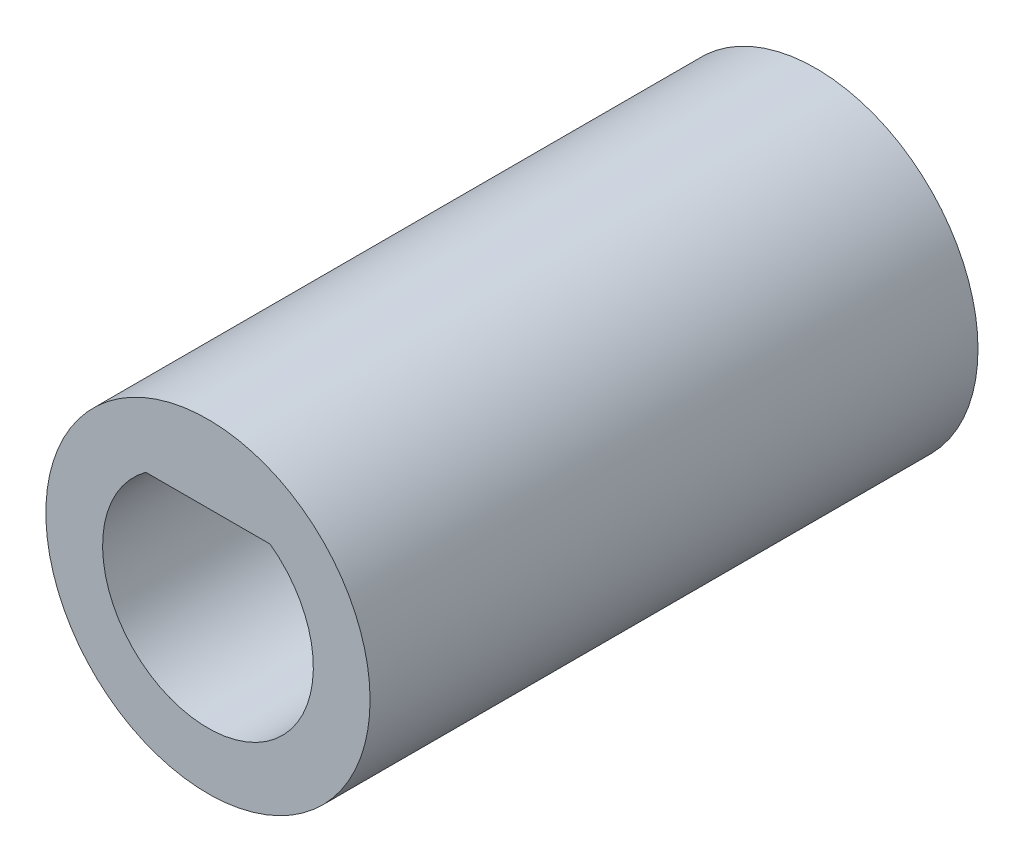
ISO-10303-21;
HEADER;
FILE_DESCRIPTION(('STEP AP214'),'2;1');
FILE_NAME('part.step','',(''),(''),'','','');
FILE_SCHEMA(('AUTOMOTIVE_DESIGN { 1 0 10303 214 1 1 1 1 }'));
ENDSEC;
DATA;
#1=APPLICATION_CONTEXT('core data for automotive mechanical design processes');
#2=APPLICATION_PROTOCOL_DEFINITION('international standard','automotive_design',2000,#1);
#3=PRODUCT_CONTEXT('',#1,'mechanical');
#4=PRODUCT('Part','Part','',(#3));
#5=PRODUCT_RELATED_PRODUCT_CATEGORY('part','',(#4));
#6=PRODUCT_DEFINITION_FORMATION('','',#4);
#7=PRODUCT_DEFINITION_CONTEXT('part definition',#1,'design');
#8=PRODUCT_DEFINITION('design','',#6,#7);
#9=PRODUCT_DEFINITION_SHAPE('','',#8);
#10=(LENGTH_UNIT() NAMED_UNIT(*) SI_UNIT(.MILLI.,.METRE.));
#11=(NAMED_UNIT(*) PLANE_ANGLE_UNIT() SI_UNIT($,.RADIAN.));
#12=(NAMED_UNIT(*) SI_UNIT($,.STERADIAN.) SOLID_ANGLE_UNIT());
#13=UNCERTAINTY_MEASURE_WITH_UNIT(LENGTH_MEASURE(1.E-05),#10,'distance_accuracy_value','');
#14=(GEOMETRIC_REPRESENTATION_CONTEXT(3) GLOBAL_UNCERTAINTY_ASSIGNED_CONTEXT((#13)) GLOBAL_UNIT_ASSIGNED_CONTEXT((#10,
#11,#12)) REPRESENTATION_CONTEXT('',''));
#15=CARTESIAN_POINT('',(0.,0.,0.));
#16=DIRECTION('',(0.,0.,1.));
#17=DIRECTION('',(1.,0.,0.));
#18=AXIS2_PLACEMENT_3D('',#15,#16,#17);
#19=CARTESIAN_POINT('',(0.,0.,0.));
#20=DIRECTION('',(0.,0.,1.));
#21=DIRECTION('',(1.,0.,0.));
#22=AXIS2_PLACEMENT_3D('',#19,#20,#21);
#23=PLANE('',#22);
#24=CARTESIAN_POINT('',(0.,0.,0.));
#25=DIRECTION('',(0.,0.,1.));
#26=DIRECTION('',(1.,0.,0.));
#27=AXIS2_PLACEMENT_3D('',#24,#25,#26);
#28=CIRCLE('',#27,2.6);
#29=CARTESIAN_POINT('',(2.51743917503482,-0.650000000000001,0.));
#30=VERTEX_POINT('',#29);
#31=CARTESIAN_POINT('',(2.51743917503482,0.65,0.));
#32=VERTEX_POINT('',#31);
#33=EDGE_CURVE('E179',#30,#32,#28,.T.);
#34=ORIENTED_EDGE('',*,*,#33,.T.);
#35=DIRECTION('',(-1.,0.,0.));
#36=VECTOR('',#35,1.);
#37=CARTESIAN_POINT('',(2.92873692912149,0.65,0.));
#38=LINE('',#37,#36);
#39=CARTESIAN_POINT('',(-2.51743917503482,0.650000000000002,0.));
#40=VERTEX_POINT('',#39);
#41=EDGE_CURVE('E121',#32,#40,#38,.T.);
#42=ORIENTED_EDGE('',*,*,#41,.T.);
#43=CARTESIAN_POINT('',(-2.51743917503482,-0.650000000000001,0.));
#44=VERTEX_POINT('',#43);
#45=EDGE_CURVE('E148',#40,#44,#28,.T.);
#46=ORIENTED_EDGE('',*,*,#45,.T.);
#47=DIRECTION('',(1.,0.,0.));
#48=VECTOR('',#47,1.);
#49=CARTESIAN_POINT('',(2.92873692912149,-0.650000000000001,0.));
#50=LINE('',#49,#48);
#51=EDGE_CURVE('E137',#44,#30,#50,.T.);
#52=ORIENTED_EDGE('',*,*,#51,.T.);
#53=EDGE_LOOP('',(#34,#42,#46,#52));
#54=FACE_BOUND('',#53,.T.);
#55=ADVANCED_FACE('F36',(#54),#23,.T.);
#56=CARTESIAN_POINT('',(0.,0.,7.5));
#57=DIRECTION('',(0.,0.,-1.));
#58=DIRECTION('',(-1.,0.,0.));
#59=AXIS2_PLACEMENT_3D('',#56,#57,#58);
#60=CYLINDRICAL_SURFACE('',#59,4.);
#61=CARTESIAN_POINT('',(0.,0.,7.5));
#62=DIRECTION('',(0.,0.,1.));
#63=DIRECTION('',(1.,0.,0.));
#64=AXIS2_PLACEMENT_3D('',#61,#62,#63);
#65=CIRCLE('',#64,4.);
#66=CARTESIAN_POINT('',(4.,0.,7.5));
#67=VERTEX_POINT('',#66);
#68=EDGE_CURVE('E11',#67,#67,#65,.T.);
#69=ORIENTED_EDGE('',*,*,#68,.F.);
#70=EDGE_LOOP('',(#69));
#71=FACE_BOUND('',#70,.T.);
#72=CARTESIAN_POINT('',(0.,0.,-7.5));
#73=DIRECTION('',(0.,0.,1.));
#74=DIRECTION('',(1.,0.,0.));
#75=AXIS2_PLACEMENT_3D('',#72,#73,#74);
#76=CIRCLE('',#75,4.);
#77=CARTESIAN_POINT('',(4.,0.,-7.5));
#78=VERTEX_POINT('',#77);
#79=EDGE_CURVE('E40',#78,#78,#76,.T.);
#80=ORIENTED_EDGE('',*,*,#79,.T.);
#81=EDGE_LOOP('',(#80));
#82=FACE_BOUND('',#81,.T.);
#83=ADVANCED_FACE('F38',(#71,#82),#60,.T.);
#84=CARTESIAN_POINT('',(0.,0.,7.5));
#85=DIRECTION('',(0.,0.,1.));
#86=DIRECTION('',(1.,0.,0.));
#87=AXIS2_PLACEMENT_3D('',#84,#85,#86);
#88=PLANE('',#87);
#89=CARTESIAN_POINT('',(0.,0.,7.5));
#90=DIRECTION('',(0.,0.,1.));
#91=DIRECTION('',(1.,0.,0.));
#92=AXIS2_PLACEMENT_3D('',#89,#90,#91);
#93=CIRCLE('',#92,2.6);
#94=CARTESIAN_POINT('',(-1.53297097167559,2.1,7.5));
#95=VERTEX_POINT('',#94);
#96=CARTESIAN_POINT('',(1.53297097167559,2.1,7.5));
#97=VERTEX_POINT('',#96);
#98=EDGE_CURVE('E127',#95,#97,#93,.T.);
#99=ORIENTED_EDGE('',*,*,#98,.F.);
#100=DIRECTION('',(-1.,0.,0.));
#101=VECTOR('',#100,1.);
#102=CARTESIAN_POINT('',(-1.53297097167559,2.1,7.5));
#103=LINE('',#102,#101);
#104=EDGE_CURVE('E153',#97,#95,#103,.T.);
#105=ORIENTED_EDGE('',*,*,#104,.F.);
#106=EDGE_LOOP('',(#99,#105));
#107=FACE_BOUND('',#106,.T.);
#108=ORIENTED_EDGE('',*,*,#68,.T.);
#109=EDGE_LOOP('',(#108));
#110=FACE_BOUND('',#109,.T.);
#111=ADVANCED_FACE('F168',(#107,#110),#88,.T.);
#112=CARTESIAN_POINT('',(0.,0.,-7.5));
#113=DIRECTION('',(0.,0.,1.));
#114=DIRECTION('',(1.,0.,0.));
#115=AXIS2_PLACEMENT_3D('',#112,#113,#114);
#116=PLANE('',#115);
#117=DIRECTION('',(-1.,0.,0.));
#118=VECTOR('',#117,1.);
#119=CARTESIAN_POINT('',(2.92873692912149,0.65,-7.5));
#120=LINE('',#119,#118);
#121=CARTESIAN_POINT('',(2.92873692912149,0.65,-7.5));
#122=VERTEX_POINT('',#121);
#123=CARTESIAN_POINT('',(-2.92873692912149,0.650000000000002,-7.5));
#124=VERTEX_POINT('',#123);
#125=EDGE_CURVE('E117',#122,#124,#120,.T.);
#126=ORIENTED_EDGE('',*,*,#125,.F.);
#127=CARTESIAN_POINT('',(0.,0.,-7.5));
#128=DIRECTION('',(0.,0.,-1.));
#129=DIRECTION('',(-1.,0.,0.));
#130=AXIS2_PLACEMENT_3D('',#127,#128,#129);
#131=CIRCLE('',#130,3.);
#132=EDGE_CURVE('E106',#124,#122,#131,.T.);
#133=ORIENTED_EDGE('',*,*,#132,.F.);
#134=EDGE_LOOP('',(#126,#133));
#135=FACE_BOUND('',#134,.T.);
#136=DIRECTION('',(1.,0.,0.));
#137=VECTOR('',#136,1.);
#138=CARTESIAN_POINT('',(2.92873692912149,-0.650000000000001,-7.5));
#139=LINE('',#138,#137);
#140=CARTESIAN_POINT('',(-2.92873692912149,-0.650000000000001,-7.5));
#141=VERTEX_POINT('',#140);
#142=CARTESIAN_POINT('',(2.92873692912149,-0.650000000000001,-7.5));
#143=VERTEX_POINT('',#142);
#144=EDGE_CURVE('E132',#141,#143,#139,.T.);
#145=ORIENTED_EDGE('',*,*,#144,.F.);
#146=CARTESIAN_POINT('',(0.,0.,-7.5));
#147=DIRECTION('',(0.,0.,-1.));
#148=DIRECTION('',(-1.,0.,0.));
#149=AXIS2_PLACEMENT_3D('',#146,#147,#148);
#150=CIRCLE('',#149,3.);
#151=EDGE_CURVE('E138',#143,#141,#150,.T.);
#152=ORIENTED_EDGE('',*,*,#151,.F.);
#153=EDGE_LOOP('',(#145,#152));
#154=FACE_BOUND('',#153,.T.);
#155=ORIENTED_EDGE('',*,*,#79,.F.);
#156=EDGE_LOOP('',(#155));
#157=FACE_BOUND('',#156,.T.);
#158=ADVANCED_FACE('F190',(#135,#154,#157),#116,.F.);
#159=CARTESIAN_POINT('',(0.,0.,0.));
#160=DIRECTION('',(0.,0.,1.));
#161=DIRECTION('',(1.,0.,0.));
#162=AXIS2_PLACEMENT_3D('',#159,#160,#161);
#163=CYLINDRICAL_SURFACE('',#162,2.6);
#164=ORIENTED_EDGE('',*,*,#98,.T.);
#165=DIRECTION('',(0.,0.,1.));
#166=VECTOR('',#165,1.);
#167=CARTESIAN_POINT('',(1.53297097167559,2.1,0.));
#168=LINE('',#167,#166);
#169=CARTESIAN_POINT('',(1.53297097167559,2.1,0.));
#170=VERTEX_POINT('',#169);
#171=EDGE_CURVE('E151',#170,#97,#168,.T.);
#172=ORIENTED_EDGE('',*,*,#171,.F.);
#173=EDGE_CURVE('E149',#32,#170,#28,.T.);
#174=ORIENTED_EDGE('',*,*,#173,.F.);
#175=ORIENTED_EDGE('',*,*,#33,.F.);
#176=EDGE_CURVE('E180',#44,#30,#28,.T.);
#177=ORIENTED_EDGE('',*,*,#176,.F.);
#178=ORIENTED_EDGE('',*,*,#45,.F.);
#179=CARTESIAN_POINT('',(-1.53297097167559,2.1,0.));
#180=VERTEX_POINT('',#179);
#181=EDGE_CURVE('E145',#180,#40,#28,.T.);
#182=ORIENTED_EDGE('',*,*,#181,.F.);
#183=DIRECTION('',(0.,0.,1.));
#184=VECTOR('',#183,1.);
#185=CARTESIAN_POINT('',(-1.53297097167559,2.1,0.));
#186=LINE('',#185,#184);
#187=EDGE_CURVE('E156',#180,#95,#186,.T.);
#188=ORIENTED_EDGE('',*,*,#187,.T.);
#189=EDGE_LOOP('',(#164,#172,#174,#175,#177,#178,#182,#188));
#190=FACE_BOUND('',#189,.T.);
#191=ADVANCED_FACE('F170',(#190),#163,.F.);
#192=CARTESIAN_POINT('',(-1.53297097167559,2.1,0.));
#193=DIRECTION('',(0.,1.,0.));
#194=DIRECTION('',(0.,0.,1.));
#195=AXIS2_PLACEMENT_3D('',#192,#193,#194);
#196=PLANE('',#195);
#197=ORIENTED_EDGE('',*,*,#104,.T.);
#198=ORIENTED_EDGE('',*,*,#187,.F.);
#199=DIRECTION('',(-1.,0.,0.));
#200=VECTOR('',#199,1.);
#201=CARTESIAN_POINT('',(-1.53297097167559,2.1,0.));
#202=LINE('',#201,#200);
#203=EDGE_CURVE('E147',#170,#180,#202,.T.);
#204=ORIENTED_EDGE('',*,*,#203,.F.);
#205=ORIENTED_EDGE('',*,*,#171,.T.);
#206=EDGE_LOOP('',(#197,#198,#204,#205));
#207=FACE_BOUND('',#206,.T.);
#208=ADVANCED_FACE('F163',(#207),#196,.F.);
#209=CARTESIAN_POINT('',(0.,0.,0.));
#210=DIRECTION('',(0.,0.,-1.));
#211=DIRECTION('',(-1.,0.,0.));
#212=AXIS2_PLACEMENT_3D('',#209,#210,#211);
#213=PLANE('',#212);
#214=ORIENTED_EDGE('',*,*,#176,.T.);
#215=CARTESIAN_POINT('',(2.92873692912149,-0.650000000000001,0.));
#216=VERTEX_POINT('',#215);
#217=EDGE_CURVE('E51',#30,#216,#50,.T.);
#218=ORIENTED_EDGE('',*,*,#217,.T.);
#219=CARTESIAN_POINT('',(0.,0.,0.));
#220=DIRECTION('',(0.,0.,-1.));
#221=DIRECTION('',(-1.,0.,0.));
#222=AXIS2_PLACEMENT_3D('',#219,#220,#221);
#223=CIRCLE('',#222,3.);
#224=CARTESIAN_POINT('',(-2.92873692912149,-0.650000000000001,0.));
#225=VERTEX_POINT('',#224);
#226=EDGE_CURVE('E129',#216,#225,#223,.T.);
#227=ORIENTED_EDGE('',*,*,#226,.T.);
#228=EDGE_CURVE('E133',#225,#44,#50,.T.);
#229=ORIENTED_EDGE('',*,*,#228,.T.);
#230=EDGE_LOOP('',(#214,#218,#227,#229));
#231=FACE_BOUND('',#230,.T.);
#232=ADVANCED_FACE('F182',(#231),#213,.T.);
#233=CARTESIAN_POINT('',(0.,0.,0.));
#234=DIRECTION('',(0.,0.,-1.));
#235=DIRECTION('',(-1.,0.,0.));
#236=AXIS2_PLACEMENT_3D('',#233,#234,#235);
#237=CYLINDRICAL_SURFACE('',#236,3.);
#238=ORIENTED_EDGE('',*,*,#151,.T.);
#239=DIRECTION('',(0.,0.,-1.));
#240=VECTOR('',#239,1.);
#241=CARTESIAN_POINT('',(-2.92873692912149,-0.650000000000001,0.));
#242=LINE('',#241,#240);
#243=EDGE_CURVE('E136',#225,#141,#242,.T.);
#244=ORIENTED_EDGE('',*,*,#243,.F.);
#245=ORIENTED_EDGE('',*,*,#226,.F.);
#246=DIRECTION('',(0.,0.,-1.));
#247=VECTOR('',#246,1.);
#248=CARTESIAN_POINT('',(2.92873692912149,-0.650000000000001,0.));
#249=LINE('',#248,#247);
#250=EDGE_CURVE('E125',#216,#143,#249,.T.);
#251=ORIENTED_EDGE('',*,*,#250,.T.);
#252=EDGE_LOOP('',(#238,#244,#245,#251));
#253=FACE_BOUND('',#252,.T.);
#254=ADVANCED_FACE('F192',(#253),#237,.F.);
#255=CARTESIAN_POINT('',(2.92873692912149,-0.650000000000001,0.));
#256=DIRECTION('',(0.,1.,0.));
#257=DIRECTION('',(0.,0.,1.));
#258=AXIS2_PLACEMENT_3D('',#255,#256,#257);
#259=PLANE('',#258);
#260=ORIENTED_EDGE('',*,*,#144,.T.);
#261=ORIENTED_EDGE('',*,*,#250,.F.);
#262=ORIENTED_EDGE('',*,*,#217,.F.);
#263=ORIENTED_EDGE('',*,*,#51,.F.);
#264=ORIENTED_EDGE('',*,*,#228,.F.);
#265=ORIENTED_EDGE('',*,*,#243,.T.);
#266=EDGE_LOOP('',(#260,#261,#262,#263,#264,#265));
#267=FACE_BOUND('',#266,.T.);
#268=ADVANCED_FACE('F185',(#267),#259,.F.);
#269=CARTESIAN_POINT('',(0.,0.,0.));
#270=DIRECTION('',(0.,0.,-1.));
#271=DIRECTION('',(-1.,0.,0.));
#272=AXIS2_PLACEMENT_3D('',#269,#270,#271);
#273=PLANE('',#272);
#274=ORIENTED_EDGE('',*,*,#181,.T.);
#275=CARTESIAN_POINT('',(-2.92873692912149,0.650000000000002,0.));
#276=VERTEX_POINT('',#275);
#277=EDGE_CURVE('E59',#40,#276,#38,.T.);
#278=ORIENTED_EDGE('',*,*,#277,.T.);
#279=CARTESIAN_POINT('',(0.,0.,0.));
#280=DIRECTION('',(0.,0.,-1.));
#281=DIRECTION('',(-1.,0.,0.));
#282=AXIS2_PLACEMENT_3D('',#279,#280,#281);
#283=CIRCLE('',#282,3.);
#284=CARTESIAN_POINT('',(2.92873692912149,0.65,0.));
#285=VERTEX_POINT('',#284);
#286=EDGE_CURVE('E104',#276,#285,#283,.T.);
#287=ORIENTED_EDGE('',*,*,#286,.T.);
#288=EDGE_CURVE('E111',#285,#32,#38,.T.);
#289=ORIENTED_EDGE('',*,*,#288,.T.);
#290=ORIENTED_EDGE('',*,*,#173,.T.);
#291=ORIENTED_EDGE('',*,*,#203,.T.);
#292=EDGE_LOOP('',(#274,#278,#287,#289,#290,#291));
#293=FACE_BOUND('',#292,.T.);
#294=ADVANCED_FACE('F115',(#293),#273,.T.);
#295=CARTESIAN_POINT('',(0.,0.,0.));
#296=DIRECTION('',(0.,0.,-1.));
#297=DIRECTION('',(-1.,0.,0.));
#298=AXIS2_PLACEMENT_3D('',#295,#296,#297);
#299=CYLINDRICAL_SURFACE('',#298,3.);
#300=ORIENTED_EDGE('',*,*,#132,.T.);
#301=DIRECTION('',(0.,0.,-1.));
#302=VECTOR('',#301,1.);
#303=CARTESIAN_POINT('',(2.92873692912149,0.65,0.));
#304=LINE('',#303,#302);
#305=EDGE_CURVE('E101',#285,#122,#304,.T.);
#306=ORIENTED_EDGE('',*,*,#305,.F.);
#307=ORIENTED_EDGE('',*,*,#286,.F.);
#308=DIRECTION('',(0.,0.,-1.));
#309=VECTOR('',#308,1.);
#310=CARTESIAN_POINT('',(-2.92873692912149,0.650000000000002,0.));
#311=LINE('',#310,#309);
#312=EDGE_CURVE('E110',#276,#124,#311,.T.);
#313=ORIENTED_EDGE('',*,*,#312,.T.);
#314=EDGE_LOOP('',(#300,#306,#307,#313));
#315=FACE_BOUND('',#314,.T.);
#316=ADVANCED_FACE('F103',(#315),#299,.F.);
#317=CARTESIAN_POINT('',(2.92873692912149,0.65,0.));
#318=DIRECTION('',(0.,-1.,0.));
#319=DIRECTION('',(1.,0.,0.));
#320=AXIS2_PLACEMENT_3D('',#317,#318,#319);
#321=PLANE('',#320);
#322=ORIENTED_EDGE('',*,*,#125,.T.);
#323=ORIENTED_EDGE('',*,*,#312,.F.);
#324=ORIENTED_EDGE('',*,*,#277,.F.);
#325=ORIENTED_EDGE('',*,*,#41,.F.);
#326=ORIENTED_EDGE('',*,*,#288,.F.);
#327=ORIENTED_EDGE('',*,*,#305,.T.);
#328=EDGE_LOOP('',(#322,#323,#324,#325,#326,#327));
#329=FACE_BOUND('',#328,.T.);
#330=ADVANCED_FACE('F119',(#329),#321,.F.);
#331=CLOSED_SHELL('',(#55,#83,#111,#158,#191,#208,#232,#254,#268,#294,#316,#330));
#332=MANIFOLD_SOLID_BREP('B2',#331);
#333=ADVANCED_BREP_SHAPE_REPRESENTATION('',(#18,#332),#14);
#334=SHAPE_DEFINITION_REPRESENTATION(#9,#333);
ENDSEC;
END-ISO-10303-21;
